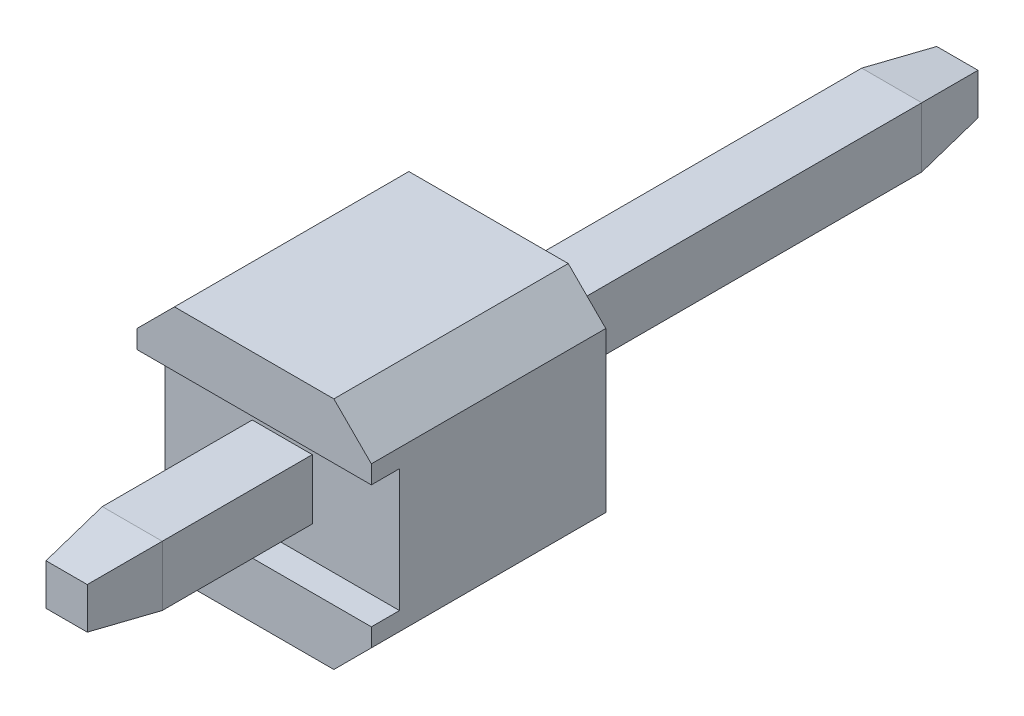
ISO-10303-21;
HEADER;
FILE_DESCRIPTION(('STEP AP214'),'2;1');
FILE_NAME('part.step','',(''),(''),'','','');
FILE_SCHEMA(('AUTOMOTIVE_DESIGN { 1 0 10303 214 1 1 1 1 }'));
ENDSEC;
DATA;
#1=APPLICATION_CONTEXT('core data for automotive mechanical design processes');
#2=APPLICATION_PROTOCOL_DEFINITION('international standard','automotive_design',2000,#1);
#3=PRODUCT_CONTEXT('',#1,'mechanical');
#4=PRODUCT('Part','Part','',(#3));
#5=PRODUCT_RELATED_PRODUCT_CATEGORY('part','',(#4));
#6=PRODUCT_DEFINITION_FORMATION('','',#4);
#7=PRODUCT_DEFINITION_CONTEXT('part definition',#1,'design');
#8=PRODUCT_DEFINITION('design','',#6,#7);
#9=PRODUCT_DEFINITION_SHAPE('','',#8);
#10=(LENGTH_UNIT() NAMED_UNIT(*) SI_UNIT(.MILLI.,.METRE.));
#11=(NAMED_UNIT(*) PLANE_ANGLE_UNIT() SI_UNIT($,.RADIAN.));
#12=(NAMED_UNIT(*) SI_UNIT($,.STERADIAN.) SOLID_ANGLE_UNIT());
#13=UNCERTAINTY_MEASURE_WITH_UNIT(LENGTH_MEASURE(1.E-05),#10,'distance_accuracy_value','');
#14=(GEOMETRIC_REPRESENTATION_CONTEXT(3) GLOBAL_UNCERTAINTY_ASSIGNED_CONTEXT((#13)) GLOBAL_UNIT_ASSIGNED_CONTEXT((#10,
#11,#12)) REPRESENTATION_CONTEXT('',''));
#15=CARTESIAN_POINT('',(0.,0.,0.));
#16=DIRECTION('',(0.,0.,1.));
#17=DIRECTION('',(1.,0.,0.));
#18=AXIS2_PLACEMENT_3D('',#15,#16,#17);
#19=CARTESIAN_POINT('',(-0.16,-0.27,-4.65));
#20=DIRECTION('',(0.,-0.989949493661167,-0.14142135623731));
#21=DIRECTION('',(0.,0.14142135623731,-0.989949493661167));
#22=AXIS2_PLACEMENT_3D('',#19,#20,#21);
#23=PLANE('',#22);
#24=DIRECTION('',(1.,0.,0.));
#25=VECTOR('',#24,1.);
#26=CARTESIAN_POINT('',(-0.16,-0.22,-5.));
#27=LINE('',#26,#25);
#28=CARTESIAN_POINT('',(-0.22,-0.22,-5.));
#29=VERTEX_POINT('',#28);
#30=CARTESIAN_POINT('',(0.22,-0.22,-5.));
#31=VERTEX_POINT('',#30);
#32=EDGE_CURVE('P0_E11',#29,#31,#27,.T.);
#33=ORIENTED_EDGE('',*,*,#32,.T.);
#34=DIRECTION('',(0.140028008402801,-0.140028008402801,0.980196058819607));
#35=VECTOR('',#34,1.);
#36=CARTESIAN_POINT('',(0.22,-0.22,-5.));
#37=LINE('',#36,#35);
#38=CARTESIAN_POINT('',(0.32,-0.32,-4.3));
#39=VERTEX_POINT('',#38);
#40=EDGE_CURVE('P0_E28',#31,#39,#37,.T.);
#41=ORIENTED_EDGE('',*,*,#40,.T.);
#42=DIRECTION('',(-1.,0.,0.));
#43=VECTOR('',#42,1.);
#44=CARTESIAN_POINT('',(-0.16,-0.32,-4.3));
#45=LINE('',#44,#43);
#46=CARTESIAN_POINT('',(-0.32,-0.32,-4.3));
#47=VERTEX_POINT('',#46);
#48=EDGE_CURVE('P0_E143',#39,#47,#45,.T.);
#49=ORIENTED_EDGE('',*,*,#48,.T.);
#50=DIRECTION('',(-0.140028008402801,-0.140028008402801,0.980196058819607));
#51=VECTOR('',#50,1.);
#52=CARTESIAN_POINT('',(-0.22,-0.22,-5.));
#53=LINE('',#52,#51);
#54=EDGE_CURVE('P0_E122',#29,#47,#53,.T.);
#55=ORIENTED_EDGE('',*,*,#54,.F.);
#56=EDGE_LOOP('',(#33,#41,#49,#55));
#57=FACE_BOUND('',#56,.T.);
#58=ADVANCED_FACE('P0_F17',(#57),#23,.T.);
#59=CARTESIAN_POINT('',(0.27,-0.16,-4.65));
#60=DIRECTION('',(0.989949493661167,0.,-0.14142135623731));
#61=DIRECTION('',(0.,-1.,0.));
#62=AXIS2_PLACEMENT_3D('',#59,#60,#61);
#63=PLANE('',#62);
#64=DIRECTION('',(0.,1.,0.));
#65=VECTOR('',#64,1.);
#66=CARTESIAN_POINT('',(0.22,-0.16,-5.));
#67=LINE('',#66,#65);
#68=CARTESIAN_POINT('',(0.22,0.22,-5.));
#69=VERTEX_POINT('',#68);
#70=EDGE_CURVE('P0_E144',#31,#69,#67,.T.);
#71=ORIENTED_EDGE('',*,*,#70,.T.);
#72=DIRECTION('',(0.140028008402801,0.140028008402801,0.980196058819607));
#73=VECTOR('',#72,1.);
#74=CARTESIAN_POINT('',(0.22,0.22,-5.));
#75=LINE('',#74,#73);
#76=CARTESIAN_POINT('',(0.32,0.32,-4.3));
#77=VERTEX_POINT('',#76);
#78=EDGE_CURVE('P0_E147',#69,#77,#75,.T.);
#79=ORIENTED_EDGE('',*,*,#78,.T.);
#80=DIRECTION('',(0.,-1.,0.));
#81=VECTOR('',#80,1.);
#82=CARTESIAN_POINT('',(0.32,-0.16,-4.3));
#83=LINE('',#82,#81);
#84=EDGE_CURVE('P0_E126',#77,#39,#83,.T.);
#85=ORIENTED_EDGE('',*,*,#84,.T.);
#86=ORIENTED_EDGE('',*,*,#40,.F.);
#87=EDGE_LOOP('',(#71,#79,#85,#86));
#88=FACE_BOUND('',#87,.T.);
#89=ADVANCED_FACE('P0_F164',(#88),#63,.T.);
#90=CARTESIAN_POINT('',(0.16,0.27,-4.65));
#91=DIRECTION('',(0.,0.989949493661167,-0.14142135623731));
#92=DIRECTION('',(-1.,0.,0.));
#93=AXIS2_PLACEMENT_3D('',#90,#91,#92);
#94=PLANE('',#93);
#95=DIRECTION('',(-1.,0.,0.));
#96=VECTOR('',#95,1.);
#97=CARTESIAN_POINT('',(0.16,0.22,-5.));
#98=LINE('',#97,#96);
#99=CARTESIAN_POINT('',(-0.22,0.22,-5.));
#100=VERTEX_POINT('',#99);
#101=EDGE_CURVE('P0_E123',#69,#100,#98,.T.);
#102=ORIENTED_EDGE('',*,*,#101,.T.);
#103=DIRECTION('',(-0.140028008402801,0.140028008402801,0.980196058819607));
#104=VECTOR('',#103,1.);
#105=CARTESIAN_POINT('',(-0.22,0.22,-5.));
#106=LINE('',#105,#104);
#107=CARTESIAN_POINT('',(-0.32,0.32,-4.3));
#108=VERTEX_POINT('',#107);
#109=EDGE_CURVE('P0_E127',#100,#108,#106,.T.);
#110=ORIENTED_EDGE('',*,*,#109,.T.);
#111=DIRECTION('',(1.,0.,0.));
#112=VECTOR('',#111,1.);
#113=CARTESIAN_POINT('',(0.16,0.32,-4.3));
#114=LINE('',#113,#112);
#115=EDGE_CURVE('P0_E98',#108,#77,#114,.T.);
#116=ORIENTED_EDGE('',*,*,#115,.T.);
#117=ORIENTED_EDGE('',*,*,#78,.F.);
#118=EDGE_LOOP('',(#102,#110,#116,#117));
#119=FACE_BOUND('',#118,.T.);
#120=ADVANCED_FACE('P0_F232',(#119),#94,.T.);
#121=CARTESIAN_POINT('',(-0.27,0.16,-4.65));
#122=DIRECTION('',(-0.989949493661167,0.,-0.14142135623731));
#123=DIRECTION('',(-0.14142135623731,0.,0.989949493661167));
#124=AXIS2_PLACEMENT_3D('',#121,#122,#123);
#125=PLANE('',#124);
#126=DIRECTION('',(0.,1.,0.));
#127=VECTOR('',#126,1.);
#128=CARTESIAN_POINT('',(-0.32,0.16,-4.3));
#129=LINE('',#128,#127);
#130=EDGE_CURVE('P0_E121',#47,#108,#129,.T.);
#131=ORIENTED_EDGE('',*,*,#130,.T.);
#132=ORIENTED_EDGE('',*,*,#109,.F.);
#133=DIRECTION('',(0.,-1.,0.));
#134=VECTOR('',#133,1.);
#135=CARTESIAN_POINT('',(-0.22,0.16,-5.));
#136=LINE('',#135,#134);
#137=EDGE_CURVE('P0_E117',#100,#29,#136,.T.);
#138=ORIENTED_EDGE('',*,*,#137,.T.);
#139=ORIENTED_EDGE('',*,*,#54,.T.);
#140=EDGE_LOOP('',(#131,#132,#138,#139));
#141=FACE_BOUND('',#140,.T.);
#142=ADVANCED_FACE('P0_F236',(#141),#125,.T.);
#143=CARTESIAN_POINT('',(-0.32,0.32,0.));
#144=DIRECTION('',(-1.,0.,0.));
#145=DIRECTION('',(0.,0.,1.));
#146=AXIS2_PLACEMENT_3D('',#143,#144,#145);
#147=PLANE('',#146);
#148=ORIENTED_EDGE('',*,*,#130,.F.);
#149=DIRECTION('',(0.,0.,1.));
#150=VECTOR('',#149,1.);
#151=CARTESIAN_POINT('',(-0.32,-0.32,0.));
#152=LINE('',#151,#150);
#153=CARTESIAN_POINT('',(-0.32,-0.32,2.));
#154=VERTEX_POINT('',#153);
#155=EDGE_CURVE('P0_E86',#47,#154,#152,.T.);
#156=ORIENTED_EDGE('',*,*,#155,.T.);
#157=DIRECTION('',(0.,-1.,0.));
#158=VECTOR('',#157,1.);
#159=CARTESIAN_POINT('',(-0.32,0.16,2.));
#160=LINE('',#159,#158);
#161=CARTESIAN_POINT('',(-0.32,0.32,2.));
#162=VERTEX_POINT('',#161);
#163=EDGE_CURVE('P0_E80',#162,#154,#160,.T.);
#164=ORIENTED_EDGE('',*,*,#163,.F.);
#165=DIRECTION('',(0.,0.,1.));
#166=VECTOR('',#165,1.);
#167=CARTESIAN_POINT('',(-0.32,0.32,0.));
#168=LINE('',#167,#166);
#169=EDGE_CURVE('P0_E84',#108,#162,#168,.T.);
#170=ORIENTED_EDGE('',*,*,#169,.F.);
#171=EDGE_LOOP('',(#148,#156,#164,#170));
#172=FACE_BOUND('',#171,.T.);
#173=ADVANCED_FACE('P0_F83',(#172),#147,.T.);
#174=CARTESIAN_POINT('',(-0.32,-0.32,0.));
#175=DIRECTION('',(0.,-1.,0.));
#176=DIRECTION('',(0.,0.,-1.));
#177=AXIS2_PLACEMENT_3D('',#174,#175,#176);
#178=PLANE('',#177);
#179=ORIENTED_EDGE('',*,*,#48,.F.);
#180=DIRECTION('',(0.,0.,1.));
#181=VECTOR('',#180,1.);
#182=CARTESIAN_POINT('',(0.32,-0.32,0.));
#183=LINE('',#182,#181);
#184=CARTESIAN_POINT('',(0.32,-0.32,2.));
#185=VERTEX_POINT('',#184);
#186=EDGE_CURVE('P0_E101',#39,#185,#183,.T.);
#187=ORIENTED_EDGE('',*,*,#186,.T.);
#188=DIRECTION('',(1.,0.,0.));
#189=VECTOR('',#188,1.);
#190=CARTESIAN_POINT('',(-0.16,-0.32,2.));
#191=LINE('',#190,#189);
#192=EDGE_CURVE('P0_E91',#154,#185,#191,.T.);
#193=ORIENTED_EDGE('',*,*,#192,.F.);
#194=ORIENTED_EDGE('',*,*,#155,.F.);
#195=EDGE_LOOP('',(#179,#187,#193,#194));
#196=FACE_BOUND('',#195,.T.);
#197=ADVANCED_FACE('P0_F19',(#196),#178,.T.);
#198=CARTESIAN_POINT('',(0.,0.,-5.));
#199=DIRECTION('',(0.,0.,-1.));
#200=DIRECTION('',(0.,-1.,0.));
#201=AXIS2_PLACEMENT_3D('',#198,#199,#200);
#202=PLANE('',#201);
#203=ORIENTED_EDGE('',*,*,#32,.F.);
#204=ORIENTED_EDGE('',*,*,#137,.F.);
#205=ORIENTED_EDGE('',*,*,#101,.F.);
#206=ORIENTED_EDGE('',*,*,#70,.F.);
#207=EDGE_LOOP('',(#203,#204,#205,#206));
#208=FACE_BOUND('',#207,.T.);
#209=ADVANCED_FACE('P0_F217',(#208),#202,.T.);
#210=CARTESIAN_POINT('',(0.32,-0.32,0.));
#211=DIRECTION('',(1.,0.,0.));
#212=DIRECTION('',(0.,1.,0.));
#213=AXIS2_PLACEMENT_3D('',#210,#211,#212);
#214=PLANE('',#213);
#215=ORIENTED_EDGE('',*,*,#84,.F.);
#216=DIRECTION('',(0.,0.,-1.));
#217=VECTOR('',#216,1.);
#218=CARTESIAN_POINT('',(0.32,0.32,0.));
#219=LINE('',#218,#217);
#220=CARTESIAN_POINT('',(0.32,0.32,2.));
#221=VERTEX_POINT('',#220);
#222=EDGE_CURVE('P0_E102',#221,#77,#219,.T.);
#223=ORIENTED_EDGE('',*,*,#222,.F.);
#224=DIRECTION('',(0.,1.,0.));
#225=VECTOR('',#224,1.);
#226=CARTESIAN_POINT('',(0.32,-0.16,2.));
#227=LINE('',#226,#225);
#228=EDGE_CURVE('P0_E107',#185,#221,#227,.T.);
#229=ORIENTED_EDGE('',*,*,#228,.F.);
#230=ORIENTED_EDGE('',*,*,#186,.F.);
#231=EDGE_LOOP('',(#215,#223,#229,#230));
#232=FACE_BOUND('',#231,.T.);
#233=ADVANCED_FACE('P0_F172',(#232),#214,.T.);
#234=CARTESIAN_POINT('',(0.32,0.32,0.));
#235=DIRECTION('',(0.,1.,0.));
#236=DIRECTION('',(1.,0.,0.));
#237=AXIS2_PLACEMENT_3D('',#234,#235,#236);
#238=PLANE('',#237);
#239=ORIENTED_EDGE('',*,*,#115,.F.);
#240=ORIENTED_EDGE('',*,*,#169,.T.);
#241=DIRECTION('',(-1.,0.,0.));
#242=VECTOR('',#241,1.);
#243=CARTESIAN_POINT('',(0.16,0.32,2.));
#244=LINE('',#243,#242);
#245=EDGE_CURVE('P0_E21',#221,#162,#244,.T.);
#246=ORIENTED_EDGE('',*,*,#245,.F.);
#247=ORIENTED_EDGE('',*,*,#222,.T.);
#248=EDGE_LOOP('',(#239,#240,#246,#247));
#249=FACE_BOUND('',#248,.T.);
#250=ADVANCED_FACE('P0_F96',(#249),#238,.T.);
#251=CARTESIAN_POINT('',(0.,0.,2.));
#252=DIRECTION('',(0.,0.,1.));
#253=DIRECTION('',(1.,0.,0.));
#254=AXIS2_PLACEMENT_3D('',#251,#252,#253);
#255=PLANE('',#254);
#256=ORIENTED_EDGE('',*,*,#245,.T.);
#257=ORIENTED_EDGE('',*,*,#163,.T.);
#258=ORIENTED_EDGE('',*,*,#192,.T.);
#259=ORIENTED_EDGE('',*,*,#228,.T.);
#260=EDGE_LOOP('',(#256,#257,#258,#259));
#261=FACE_BOUND('',#260,.T.);
#262=ADVANCED_FACE('P0_F105',(#261),#255,.T.);
#263=CLOSED_SHELL('',(#58,#89,#120,#142,#173,#197,#209,#233,#250,#262));
#264=MANIFOLD_SOLID_BREP('P0_B1',#263);
#265=CARTESIAN_POINT('',(-1.25,0.655430015301126,2.5));
#266=DIRECTION('',(0.,1.,0.));
#267=DIRECTION('',(1.,0.,0.));
#268=AXIS2_PLACEMENT_3D('',#265,#266,#267);
#269=PLANE('',#268);
#270=DIRECTION('',(1.,0.,0.));
#271=VECTOR('',#270,1.);
#272=CARTESIAN_POINT('',(-0.625,0.655430015301126,2.5));
#273=LINE('',#272,#271);
#274=CARTESIAN_POINT('',(-1.25,0.655430015301126,2.5));
#275=VERTEX_POINT('',#274);
#276=CARTESIAN_POINT('',(1.25,0.655430015301126,2.5));
#277=VERTEX_POINT('',#276);
#278=EDGE_CURVE('P1_E231',#275,#277,#273,.T.);
#279=ORIENTED_EDGE('',*,*,#278,.F.);
#280=DIRECTION('',(0.,0.,1.));
#281=VECTOR('',#280,1.);
#282=CARTESIAN_POINT('',(-1.25,0.655430015301126,1.25));
#283=LINE('',#282,#281);
#284=CARTESIAN_POINT('',(-1.25,0.655430015301126,2.2));
#285=VERTEX_POINT('',#284);
#286=EDGE_CURVE('P1_E41',#285,#275,#283,.T.);
#287=ORIENTED_EDGE('',*,*,#286,.F.);
#288=DIRECTION('',(1.,0.,0.));
#289=VECTOR('',#288,1.);
#290=CARTESIAN_POINT('',(-1.25,0.655430015301126,2.2));
#291=LINE('',#290,#289);
#292=CARTESIAN_POINT('',(1.25,0.655430015301126,2.2));
#293=VERTEX_POINT('',#292);
#294=EDGE_CURVE('P1_E11',#285,#293,#291,.T.);
#295=ORIENTED_EDGE('',*,*,#294,.T.);
#296=DIRECTION('',(0.,0.,-1.));
#297=VECTOR('',#296,1.);
#298=CARTESIAN_POINT('',(1.25,0.655430015301126,1.25));
#299=LINE('',#298,#297);
#300=EDGE_CURVE('P1_E243',#277,#293,#299,.T.);
#301=ORIENTED_EDGE('',*,*,#300,.F.);
#302=EDGE_LOOP('',(#279,#287,#295,#301));
#303=FACE_BOUND('',#302,.T.);
#304=ADVANCED_FACE('P1_F17',(#303),#269,.F.);
#305=CARTESIAN_POINT('',(1.25,-0.655430015301126,2.5));
#306=DIRECTION('',(0.,-1.,0.));
#307=DIRECTION('',(0.,0.,-1.));
#308=AXIS2_PLACEMENT_3D('',#305,#306,#307);
#309=PLANE('',#308);
#310=DIRECTION('',(-1.,0.,0.));
#311=VECTOR('',#310,1.);
#312=CARTESIAN_POINT('',(0.625,-0.655430015301126,2.5));
#313=LINE('',#312,#311);
#314=CARTESIAN_POINT('',(1.25,-0.655430015301126,2.5));
#315=VERTEX_POINT('',#314);
#316=CARTESIAN_POINT('',(-1.25,-0.655430015301126,2.5));
#317=VERTEX_POINT('',#316);
#318=EDGE_CURVE('P1_E235',#315,#317,#313,.T.);
#319=ORIENTED_EDGE('',*,*,#318,.F.);
#320=DIRECTION('',(0.,0.,1.));
#321=VECTOR('',#320,1.);
#322=CARTESIAN_POINT('',(1.25,-0.655430015301126,1.25));
#323=LINE('',#322,#321);
#324=CARTESIAN_POINT('',(1.25,-0.655430015301126,2.2));
#325=VERTEX_POINT('',#324);
#326=EDGE_CURVE('P1_E298',#325,#315,#323,.T.);
#327=ORIENTED_EDGE('',*,*,#326,.F.);
#328=DIRECTION('',(-1.,0.,0.));
#329=VECTOR('',#328,1.);
#330=CARTESIAN_POINT('',(1.25,-0.655430015301126,2.2));
#331=LINE('',#330,#329);
#332=CARTESIAN_POINT('',(-1.25,-0.655430015301126,2.2));
#333=VERTEX_POINT('',#332);
#334=EDGE_CURVE('P1_E28',#325,#333,#331,.T.);
#335=ORIENTED_EDGE('',*,*,#334,.T.);
#336=DIRECTION('',(0.,0.,-1.));
#337=VECTOR('',#336,1.);
#338=CARTESIAN_POINT('',(-1.25,-0.655430015301126,1.25));
#339=LINE('',#338,#337);
#340=EDGE_CURVE('P1_E242',#317,#333,#339,.T.);
#341=ORIENTED_EDGE('',*,*,#340,.F.);
#342=EDGE_LOOP('',(#319,#327,#335,#341));
#343=FACE_BOUND('',#342,.T.);
#344=ADVANCED_FACE('P1_F409',(#343),#309,.F.);
#345=CARTESIAN_POINT('',(0.,0.,2.2));
#346=DIRECTION('',(0.,0.,-1.));
#347=DIRECTION('',(0.,-1.,0.));
#348=AXIS2_PLACEMENT_3D('',#345,#346,#347);
#349=PLANE('',#348);
#350=DIRECTION('',(0.,-1.,0.));
#351=VECTOR('',#350,1.);
#352=CARTESIAN_POINT('',(1.25,-0.625,2.2));
#353=LINE('',#352,#351);
#354=EDGE_CURVE('P1_E246',#293,#325,#353,.T.);
#355=ORIENTED_EDGE('',*,*,#354,.F.);
#356=ORIENTED_EDGE('',*,*,#294,.F.);
#357=DIRECTION('',(0.,1.,0.));
#358=VECTOR('',#357,1.);
#359=CARTESIAN_POINT('',(-1.25,0.625,2.2));
#360=LINE('',#359,#358);
#361=EDGE_CURVE('P1_E306',#333,#285,#360,.T.);
#362=ORIENTED_EDGE('',*,*,#361,.F.);
#363=ORIENTED_EDGE('',*,*,#334,.F.);
#364=EDGE_LOOP('',(#355,#356,#362,#363));
#365=FACE_BOUND('',#364,.T.);
#366=DIRECTION('',(0.,-1.,0.));
#367=VECTOR('',#366,1.);
#368=CARTESIAN_POINT('',(-0.32,-0.16,2.2));
#369=LINE('',#368,#367);
#370=CARTESIAN_POINT('',(-0.32,0.32,2.2));
#371=VERTEX_POINT('',#370);
#372=CARTESIAN_POINT('',(-0.32,-0.32,2.2));
#373=VERTEX_POINT('',#372);
#374=EDGE_CURVE('P1_E225',#371,#373,#369,.T.);
#375=ORIENTED_EDGE('',*,*,#374,.F.);
#376=DIRECTION('',(-1.,0.,0.));
#377=VECTOR('',#376,1.);
#378=CARTESIAN_POINT('',(-0.16,0.32,2.2));
#379=LINE('',#378,#377);
#380=CARTESIAN_POINT('',(0.32,0.32,2.2));
#381=VERTEX_POINT('',#380);
#382=EDGE_CURVE('P1_E215',#381,#371,#379,.T.);
#383=ORIENTED_EDGE('',*,*,#382,.F.);
#384=DIRECTION('',(0.,1.,0.));
#385=VECTOR('',#384,1.);
#386=CARTESIAN_POINT('',(0.32,0.16,2.2));
#387=LINE('',#386,#385);
#388=CARTESIAN_POINT('',(0.32,-0.32,2.2));
#389=VERTEX_POINT('',#388);
#390=EDGE_CURVE('P1_E297',#389,#381,#387,.T.);
#391=ORIENTED_EDGE('',*,*,#390,.F.);
#392=DIRECTION('',(1.,0.,0.));
#393=VECTOR('',#392,1.);
#394=CARTESIAN_POINT('',(0.16,-0.32,2.2));
#395=LINE('',#394,#393);
#396=EDGE_CURVE('P1_E250',#373,#389,#395,.T.);
#397=ORIENTED_EDGE('',*,*,#396,.F.);
#398=EDGE_LOOP('',(#375,#383,#391,#397));
#399=FACE_BOUND('',#398,.T.);
#400=ADVANCED_FACE('P1_F415',(#365,#399),#349,.F.);
#401=CARTESIAN_POINT('',(0.,0.,2.5));
#402=DIRECTION('',(0.,0.,1.));
#403=DIRECTION('',(1.,0.,0.));
#404=AXIS2_PLACEMENT_3D('',#401,#402,#403);
#405=PLANE('',#404);
#406=ORIENTED_EDGE('',*,*,#318,.T.);
#407=DIRECTION('',(0.,-1.,0.));
#408=VECTOR('',#407,1.);
#409=CARTESIAN_POINT('',(-1.25,-1.25,2.5));
#410=LINE('',#409,#408);
#411=CARTESIAN_POINT('',(-1.25,-0.85,2.5));
#412=VERTEX_POINT('',#411);
#413=EDGE_CURVE('P1_E239',#317,#412,#410,.T.);
#414=ORIENTED_EDGE('',*,*,#413,.T.);
#415=DIRECTION('',(-0.707106781186548,0.707106781186548,0.));
#416=VECTOR('',#415,1.);
#417=CARTESIAN_POINT('',(-1.05,-1.05,2.5));
#418=LINE('',#417,#416);
#419=CARTESIAN_POINT('',(-0.85,-1.25,2.5));
#420=VERTEX_POINT('',#419);
#421=EDGE_CURVE('P1_E261',#420,#412,#418,.T.);
#422=ORIENTED_EDGE('',*,*,#421,.F.);
#423=DIRECTION('',(1.,0.,0.));
#424=VECTOR('',#423,1.);
#425=CARTESIAN_POINT('',(1.25,-1.25,2.5));
#426=LINE('',#425,#424);
#427=CARTESIAN_POINT('',(0.85,-1.25,2.5));
#428=VERTEX_POINT('',#427);
#429=EDGE_CURVE('P1_E266',#420,#428,#426,.T.);
#430=ORIENTED_EDGE('',*,*,#429,.T.);
#431=DIRECTION('',(-0.707106781186548,-0.707106781186548,0.));
#432=VECTOR('',#431,1.);
#433=CARTESIAN_POINT('',(1.05,-1.05,2.5));
#434=LINE('',#433,#432);
#435=CARTESIAN_POINT('',(1.25,-0.85,2.5));
#436=VERTEX_POINT('',#435);
#437=EDGE_CURVE('P1_E203',#436,#428,#434,.T.);
#438=ORIENTED_EDGE('',*,*,#437,.F.);
#439=DIRECTION('',(0.,1.,0.));
#440=VECTOR('',#439,1.);
#441=CARTESIAN_POINT('',(1.25,1.25,2.5));
#442=LINE('',#441,#440);
#443=EDGE_CURVE('P1_E233',#436,#315,#442,.T.);
#444=ORIENTED_EDGE('',*,*,#443,.T.);
#445=EDGE_LOOP('',(#406,#414,#422,#430,#438,#444));
#446=FACE_BOUND('',#445,.T.);
#447=ADVANCED_FACE('P1_F426',(#446),#405,.T.);
#448=CARTESIAN_POINT('',(0.,0.,2.5));
#449=DIRECTION('',(0.,0.,1.));
#450=DIRECTION('',(1.,0.,0.));
#451=AXIS2_PLACEMENT_3D('',#448,#449,#450);
#452=PLANE('',#451);
#453=ORIENTED_EDGE('',*,*,#278,.T.);
#454=DIRECTION('',(0.,1.,0.));
#455=VECTOR('',#454,1.);
#456=CARTESIAN_POINT('',(1.25,1.25,2.5));
#457=LINE('',#456,#455);
#458=CARTESIAN_POINT('',(1.25,0.85,2.5));
#459=VERTEX_POINT('',#458);
#460=EDGE_CURVE('P1_E187',#277,#459,#457,.T.);
#461=ORIENTED_EDGE('',*,*,#460,.T.);
#462=DIRECTION('',(0.707106781186548,-0.707106781186548,0.));
#463=VECTOR('',#462,1.);
#464=CARTESIAN_POINT('',(1.05,1.05,2.5));
#465=LINE('',#464,#463);
#466=CARTESIAN_POINT('',(0.85,1.25,2.5));
#467=VERTEX_POINT('',#466);
#468=EDGE_CURVE('P1_E182',#467,#459,#465,.T.);
#469=ORIENTED_EDGE('',*,*,#468,.F.);
#470=DIRECTION('',(-1.,0.,0.));
#471=VECTOR('',#470,1.);
#472=CARTESIAN_POINT('',(-1.25,1.25,2.5));
#473=LINE('',#472,#471);
#474=CARTESIAN_POINT('',(-0.85,1.25,2.5));
#475=VERTEX_POINT('',#474);
#476=EDGE_CURVE('P1_E178',#467,#475,#473,.T.);
#477=ORIENTED_EDGE('',*,*,#476,.T.);
#478=DIRECTION('',(0.707106781186548,0.707106781186548,0.));
#479=VECTOR('',#478,1.);
#480=CARTESIAN_POINT('',(-1.05,1.05,2.5));
#481=LINE('',#480,#479);
#482=CARTESIAN_POINT('',(-1.25,0.85,2.5));
#483=VERTEX_POINT('',#482);
#484=EDGE_CURVE('P1_E165',#483,#475,#481,.T.);
#485=ORIENTED_EDGE('',*,*,#484,.F.);
#486=DIRECTION('',(0.,-1.,0.));
#487=VECTOR('',#486,1.);
#488=CARTESIAN_POINT('',(-1.25,-1.25,2.5));
#489=LINE('',#488,#487);
#490=EDGE_CURVE('P1_E188',#483,#275,#489,.T.);
#491=ORIENTED_EDGE('',*,*,#490,.T.);
#492=EDGE_LOOP('',(#453,#461,#469,#477,#485,#491));
#493=FACE_BOUND('',#492,.T.);
#494=ADVANCED_FACE('P1_F180',(#493),#452,.T.);
#495=CARTESIAN_POINT('',(1.25,-1.25,0.));
#496=DIRECTION('',(1.,0.,0.));
#497=DIRECTION('',(0.,1.,0.));
#498=AXIS2_PLACEMENT_3D('',#495,#496,#497);
#499=PLANE('',#498);
#500=ORIENTED_EDGE('',*,*,#300,.T.);
#501=ORIENTED_EDGE('',*,*,#354,.T.);
#502=ORIENTED_EDGE('',*,*,#326,.T.);
#503=ORIENTED_EDGE('',*,*,#443,.F.);
#504=DIRECTION('',(0.,0.,1.));
#505=VECTOR('',#504,1.);
#506=CARTESIAN_POINT('',(1.25,-0.85,0.));
#507=LINE('',#506,#505);
#508=CARTESIAN_POINT('',(1.25,-0.85,0.));
#509=VERTEX_POINT('',#508);
#510=EDGE_CURVE('P1_E313',#509,#436,#507,.T.);
#511=ORIENTED_EDGE('',*,*,#510,.F.);
#512=DIRECTION('',(0.,-1.,0.));
#513=VECTOR('',#512,1.);
#514=CARTESIAN_POINT('',(1.25,1.25,0.));
#515=LINE('',#514,#513);
#516=CARTESIAN_POINT('',(1.25,0.85,0.));
#517=VERTEX_POINT('',#516);
#518=EDGE_CURVE('P1_E211',#517,#509,#515,.T.);
#519=ORIENTED_EDGE('',*,*,#518,.F.);
#520=DIRECTION('',(0.,0.,-1.));
#521=VECTOR('',#520,1.);
#522=CARTESIAN_POINT('',(1.25,0.85,0.));
#523=LINE('',#522,#521);
#524=EDGE_CURVE('P1_E214',#459,#517,#523,.T.);
#525=ORIENTED_EDGE('',*,*,#524,.F.);
#526=ORIENTED_EDGE('',*,*,#460,.F.);
#527=EDGE_LOOP('',(#500,#501,#502,#503,#511,#519,#525,#526));
#528=FACE_BOUND('',#527,.T.);
#529=ADVANCED_FACE('P1_F348',(#528),#499,.T.);
#530=CARTESIAN_POINT('',(0.32,0.32,0.));
#531=DIRECTION('',(-1.,0.,0.));
#532=DIRECTION('',(0.,0.,1.));
#533=AXIS2_PLACEMENT_3D('',#530,#531,#532);
#534=PLANE('',#533);
#535=ORIENTED_EDGE('',*,*,#390,.T.);
#536=DIRECTION('',(0.,0.,1.));
#537=VECTOR('',#536,1.);
#538=CARTESIAN_POINT('',(0.32,0.32,0.));
#539=LINE('',#538,#537);
#540=CARTESIAN_POINT('',(0.32,0.32,0.));
#541=VERTEX_POINT('',#540);
#542=EDGE_CURVE('P1_E264',#541,#381,#539,.T.);
#543=ORIENTED_EDGE('',*,*,#542,.F.);
#544=DIRECTION('',(0.,-1.,0.));
#545=VECTOR('',#544,1.);
#546=CARTESIAN_POINT('',(0.32,0.32,0.));
#547=LINE('',#546,#545);
#548=CARTESIAN_POINT('',(0.32,-0.32,0.));
#549=VERTEX_POINT('',#548);
#550=EDGE_CURVE('P1_E273',#541,#549,#547,.T.);
#551=ORIENTED_EDGE('',*,*,#550,.T.);
#552=DIRECTION('',(0.,0.,1.));
#553=VECTOR('',#552,1.);
#554=CARTESIAN_POINT('',(0.32,-0.32,0.));
#555=LINE('',#554,#553);
#556=EDGE_CURVE('P1_E219',#549,#389,#555,.T.);
#557=ORIENTED_EDGE('',*,*,#556,.T.);
#558=EDGE_LOOP('',(#535,#543,#551,#557));
#559=FACE_BOUND('',#558,.T.);
#560=ADVANCED_FACE('P1_F437',(#559),#534,.T.);
#561=CARTESIAN_POINT('',(-0.32,0.32,0.));
#562=DIRECTION('',(0.,-1.,0.));
#563=DIRECTION('',(0.,0.,-1.));
#564=AXIS2_PLACEMENT_3D('',#561,#562,#563);
#565=PLANE('',#564);
#566=ORIENTED_EDGE('',*,*,#382,.T.);
#567=DIRECTION('',(0.,0.,1.));
#568=VECTOR('',#567,1.);
#569=CARTESIAN_POINT('',(-0.32,0.32,0.));
#570=LINE('',#569,#568);
#571=CARTESIAN_POINT('',(-0.32,0.32,0.));
#572=VERTEX_POINT('',#571);
#573=EDGE_CURVE('P1_E226',#572,#371,#570,.T.);
#574=ORIENTED_EDGE('',*,*,#573,.F.);
#575=DIRECTION('',(1.,0.,0.));
#576=VECTOR('',#575,1.);
#577=CARTESIAN_POINT('',(-0.32,0.32,0.));
#578=LINE('',#577,#576);
#579=EDGE_CURVE('P1_E220',#572,#541,#578,.T.);
#580=ORIENTED_EDGE('',*,*,#579,.T.);
#581=ORIENTED_EDGE('',*,*,#542,.T.);
#582=EDGE_LOOP('',(#566,#574,#580,#581));
#583=FACE_BOUND('',#582,.T.);
#584=ADVANCED_FACE('P1_F424',(#583),#565,.T.);
#585=CARTESIAN_POINT('',(-1.05,-1.05,0.));
#586=DIRECTION('',(-0.707106781186548,-0.707106781186548,0.));
#587=DIRECTION('',(-0.707106781186548,0.707106781186548,0.));
#588=AXIS2_PLACEMENT_3D('',#585,#586,#587);
#589=PLANE('',#588);
#590=ORIENTED_EDGE('',*,*,#421,.T.);
#591=DIRECTION('',(0.,0.,-1.));
#592=VECTOR('',#591,1.);
#593=CARTESIAN_POINT('',(-1.25,-0.85,0.));
#594=LINE('',#593,#592);
#595=CARTESIAN_POINT('',(-1.25,-0.85,0.));
#596=VERTEX_POINT('',#595);
#597=EDGE_CURVE('P1_E265',#412,#596,#594,.T.);
#598=ORIENTED_EDGE('',*,*,#597,.T.);
#599=DIRECTION('',(0.707106781186548,-0.707106781186548,0.));
#600=VECTOR('',#599,1.);
#601=CARTESIAN_POINT('',(-1.05,-1.05,0.));
#602=LINE('',#601,#600);
#603=CARTESIAN_POINT('',(-0.85,-1.25,0.));
#604=VERTEX_POINT('',#603);
#605=EDGE_CURVE('P1_E255',#596,#604,#602,.T.);
#606=ORIENTED_EDGE('',*,*,#605,.T.);
#607=DIRECTION('',(0.,0.,1.));
#608=VECTOR('',#607,1.);
#609=CARTESIAN_POINT('',(-0.85,-1.25,0.));
#610=LINE('',#609,#608);
#611=EDGE_CURVE('P1_E251',#604,#420,#610,.T.);
#612=ORIENTED_EDGE('',*,*,#611,.T.);
#613=EDGE_LOOP('',(#590,#598,#606,#612));
#614=FACE_BOUND('',#613,.T.);
#615=ADVANCED_FACE('P1_F420',(#614),#589,.T.);
#616=CARTESIAN_POINT('',(-1.25,-1.25,0.));
#617=DIRECTION('',(0.,-1.,0.));
#618=DIRECTION('',(0.,0.,-1.));
#619=AXIS2_PLACEMENT_3D('',#616,#617,#618);
#620=PLANE('',#619);
#621=ORIENTED_EDGE('',*,*,#611,.F.);
#622=DIRECTION('',(-1.,0.,0.));
#623=VECTOR('',#622,1.);
#624=CARTESIAN_POINT('',(1.25,-1.25,0.));
#625=LINE('',#624,#623);
#626=CARTESIAN_POINT('',(0.85,-1.25,0.));
#627=VERTEX_POINT('',#626);
#628=EDGE_CURVE('P1_E175',#627,#604,#625,.T.);
#629=ORIENTED_EDGE('',*,*,#628,.F.);
#630=DIRECTION('',(0.,0.,-1.));
#631=VECTOR('',#630,1.);
#632=CARTESIAN_POINT('',(0.85,-1.25,0.));
#633=LINE('',#632,#631);
#634=EDGE_CURVE('P1_E207',#428,#627,#633,.T.);
#635=ORIENTED_EDGE('',*,*,#634,.F.);
#636=ORIENTED_EDGE('',*,*,#429,.F.);
#637=EDGE_LOOP('',(#621,#629,#635,#636));
#638=FACE_BOUND('',#637,.T.);
#639=ADVANCED_FACE('P1_F423',(#638),#620,.T.);
#640=CARTESIAN_POINT('',(0.,0.,0.));
#641=DIRECTION('',(0.,0.,1.));
#642=DIRECTION('',(1.,0.,0.));
#643=AXIS2_PLACEMENT_3D('',#640,#641,#642);
#644=PLANE('',#643);
#645=ORIENTED_EDGE('',*,*,#605,.F.);
#646=DIRECTION('',(0.,1.,0.));
#647=VECTOR('',#646,1.);
#648=CARTESIAN_POINT('',(-1.25,-1.25,0.));
#649=LINE('',#648,#647);
#650=CARTESIAN_POINT('',(-1.25,0.85,0.));
#651=VERTEX_POINT('',#650);
#652=EDGE_CURVE('P1_E210',#596,#651,#649,.T.);
#653=ORIENTED_EDGE('',*,*,#652,.T.);
#654=DIRECTION('',(-0.707106781186548,-0.707106781186548,0.));
#655=VECTOR('',#654,1.);
#656=CARTESIAN_POINT('',(-1.05,1.05,0.));
#657=LINE('',#656,#655);
#658=CARTESIAN_POINT('',(-0.85,1.25,0.));
#659=VERTEX_POINT('',#658);
#660=EDGE_CURVE('P1_E194',#659,#651,#657,.T.);
#661=ORIENTED_EDGE('',*,*,#660,.F.);
#662=DIRECTION('',(1.,0.,0.));
#663=VECTOR('',#662,1.);
#664=CARTESIAN_POINT('',(-1.25,1.25,0.));
#665=LINE('',#664,#663);
#666=CARTESIAN_POINT('',(0.85,1.25,0.));
#667=VERTEX_POINT('',#666);
#668=EDGE_CURVE('P1_E192',#659,#667,#665,.T.);
#669=ORIENTED_EDGE('',*,*,#668,.T.);
#670=DIRECTION('',(-0.707106781186548,0.707106781186548,0.));
#671=VECTOR('',#670,1.);
#672=CARTESIAN_POINT('',(1.05,1.05,0.));
#673=LINE('',#672,#671);
#674=EDGE_CURVE('P1_E258',#517,#667,#673,.T.);
#675=ORIENTED_EDGE('',*,*,#674,.F.);
#676=ORIENTED_EDGE('',*,*,#518,.T.);
#677=DIRECTION('',(0.707106781186548,0.707106781186548,0.));
#678=VECTOR('',#677,1.);
#679=CARTESIAN_POINT('',(1.05,-1.05,0.));
#680=LINE('',#679,#678);
#681=EDGE_CURVE('P1_E319',#627,#509,#680,.T.);
#682=ORIENTED_EDGE('',*,*,#681,.F.);
#683=ORIENTED_EDGE('',*,*,#628,.T.);
#684=EDGE_LOOP('',(#645,#653,#661,#669,#675,#676,#682,#683));
#685=FACE_BOUND('',#684,.T.);
#686=ORIENTED_EDGE('',*,*,#579,.F.);
#687=DIRECTION('',(0.,1.,0.));
#688=VECTOR('',#687,1.);
#689=CARTESIAN_POINT('',(-0.32,-0.32,0.));
#690=LINE('',#689,#688);
#691=CARTESIAN_POINT('',(-0.32,-0.32,0.));
#692=VERTEX_POINT('',#691);
#693=EDGE_CURVE('P1_E221',#692,#572,#690,.T.);
#694=ORIENTED_EDGE('',*,*,#693,.F.);
#695=DIRECTION('',(-1.,0.,0.));
#696=VECTOR('',#695,1.);
#697=CARTESIAN_POINT('',(0.32,-0.32,0.));
#698=LINE('',#697,#696);
#699=EDGE_CURVE('P1_E21',#549,#692,#698,.T.);
#700=ORIENTED_EDGE('',*,*,#699,.F.);
#701=ORIENTED_EDGE('',*,*,#550,.F.);
#702=EDGE_LOOP('',(#686,#694,#700,#701));
#703=FACE_BOUND('',#702,.T.);
#704=ADVANCED_FACE('P1_F19',(#685,#703),#644,.F.);
#705=CARTESIAN_POINT('',(-1.05,1.05,0.));
#706=DIRECTION('',(-0.707106781186548,0.707106781186548,0.));
#707=DIRECTION('',(0.,0.,1.));
#708=AXIS2_PLACEMENT_3D('',#705,#706,#707);
#709=PLANE('',#708);
#710=ORIENTED_EDGE('',*,*,#484,.T.);
#711=DIRECTION('',(0.,0.,-1.));
#712=VECTOR('',#711,1.);
#713=CARTESIAN_POINT('',(-0.85,1.25,0.));
#714=LINE('',#713,#712);
#715=EDGE_CURVE('P1_E169',#475,#659,#714,.T.);
#716=ORIENTED_EDGE('',*,*,#715,.T.);
#717=ORIENTED_EDGE('',*,*,#660,.T.);
#718=DIRECTION('',(0.,0.,1.));
#719=VECTOR('',#718,1.);
#720=CARTESIAN_POINT('',(-1.25,0.85,0.));
#721=LINE('',#720,#719);
#722=EDGE_CURVE('P1_E171',#651,#483,#721,.T.);
#723=ORIENTED_EDGE('',*,*,#722,.T.);
#724=EDGE_LOOP('',(#710,#716,#717,#723));
#725=FACE_BOUND('',#724,.T.);
#726=ADVANCED_FACE('P1_F167',(#725),#709,.T.);
#727=CARTESIAN_POINT('',(1.25,1.25,0.));
#728=DIRECTION('',(0.,1.,0.));
#729=DIRECTION('',(1.,0.,0.));
#730=AXIS2_PLACEMENT_3D('',#727,#728,#729);
#731=PLANE('',#730);
#732=ORIENTED_EDGE('',*,*,#715,.F.);
#733=ORIENTED_EDGE('',*,*,#476,.F.);
#734=DIRECTION('',(0.,0.,1.));
#735=VECTOR('',#734,1.);
#736=CARTESIAN_POINT('',(0.85,1.25,0.));
#737=LINE('',#736,#735);
#738=EDGE_CURVE('P1_E206',#667,#467,#737,.T.);
#739=ORIENTED_EDGE('',*,*,#738,.F.);
#740=ORIENTED_EDGE('',*,*,#668,.F.);
#741=EDGE_LOOP('',(#732,#733,#739,#740));
#742=FACE_BOUND('',#741,.T.);
#743=ADVANCED_FACE('P1_F190',(#742),#731,.T.);
#744=CARTESIAN_POINT('',(1.05,1.05,0.));
#745=DIRECTION('',(0.707106781186548,0.707106781186548,0.));
#746=DIRECTION('',(0.,0.,-1.));
#747=AXIS2_PLACEMENT_3D('',#744,#745,#746);
#748=PLANE('',#747);
#749=ORIENTED_EDGE('',*,*,#468,.T.);
#750=ORIENTED_EDGE('',*,*,#524,.T.);
#751=ORIENTED_EDGE('',*,*,#674,.T.);
#752=ORIENTED_EDGE('',*,*,#738,.T.);
#753=EDGE_LOOP('',(#749,#750,#751,#752));
#754=FACE_BOUND('',#753,.T.);
#755=ADVANCED_FACE('P1_F351',(#754),#748,.T.);
#756=CARTESIAN_POINT('',(1.05,-1.05,0.));
#757=DIRECTION('',(0.707106781186548,-0.707106781186548,0.));
#758=DIRECTION('',(0.,0.,-1.));
#759=AXIS2_PLACEMENT_3D('',#756,#757,#758);
#760=PLANE('',#759);
#761=ORIENTED_EDGE('',*,*,#437,.T.);
#762=ORIENTED_EDGE('',*,*,#634,.T.);
#763=ORIENTED_EDGE('',*,*,#681,.T.);
#764=ORIENTED_EDGE('',*,*,#510,.T.);
#765=EDGE_LOOP('',(#761,#762,#763,#764));
#766=FACE_BOUND('',#765,.T.);
#767=ADVANCED_FACE('P1_F434',(#766),#760,.T.);
#768=CARTESIAN_POINT('',(-0.32,-0.32,0.));
#769=DIRECTION('',(1.,0.,0.));
#770=DIRECTION('',(0.,1.,0.));
#771=AXIS2_PLACEMENT_3D('',#768,#769,#770);
#772=PLANE('',#771);
#773=ORIENTED_EDGE('',*,*,#374,.T.);
#774=DIRECTION('',(0.,0.,1.));
#775=VECTOR('',#774,1.);
#776=CARTESIAN_POINT('',(-0.32,-0.32,0.));
#777=LINE('',#776,#775);
#778=EDGE_CURVE('P1_E227',#692,#373,#777,.T.);
#779=ORIENTED_EDGE('',*,*,#778,.F.);
#780=ORIENTED_EDGE('',*,*,#693,.T.);
#781=ORIENTED_EDGE('',*,*,#573,.T.);
#782=EDGE_LOOP('',(#773,#779,#780,#781));
#783=FACE_BOUND('',#782,.T.);
#784=ADVANCED_FACE('P1_F404',(#783),#772,.T.);
#785=CARTESIAN_POINT('',(0.32,-0.32,0.));
#786=DIRECTION('',(0.,1.,0.));
#787=DIRECTION('',(1.,0.,0.));
#788=AXIS2_PLACEMENT_3D('',#785,#786,#787);
#789=PLANE('',#788);
#790=ORIENTED_EDGE('',*,*,#396,.T.);
#791=ORIENTED_EDGE('',*,*,#556,.F.);
#792=ORIENTED_EDGE('',*,*,#699,.T.);
#793=ORIENTED_EDGE('',*,*,#778,.T.);
#794=EDGE_LOOP('',(#790,#791,#792,#793));
#795=FACE_BOUND('',#794,.T.);
#796=ADVANCED_FACE('P1_F399',(#795),#789,.T.);
#797=CARTESIAN_POINT('',(-1.25,1.25,0.));
#798=DIRECTION('',(-1.,0.,0.));
#799=DIRECTION('',(0.,0.,1.));
#800=AXIS2_PLACEMENT_3D('',#797,#798,#799);
#801=PLANE('',#800);
#802=ORIENTED_EDGE('',*,*,#286,.T.);
#803=ORIENTED_EDGE('',*,*,#490,.F.);
#804=ORIENTED_EDGE('',*,*,#722,.F.);
#805=ORIENTED_EDGE('',*,*,#652,.F.);
#806=ORIENTED_EDGE('',*,*,#597,.F.);
#807=ORIENTED_EDGE('',*,*,#413,.F.);
#808=ORIENTED_EDGE('',*,*,#340,.T.);
#809=ORIENTED_EDGE('',*,*,#361,.T.);
#810=EDGE_LOOP('',(#802,#803,#804,#805,#806,#807,#808,#809));
#811=FACE_BOUND('',#810,.T.);
#812=ADVANCED_FACE('P1_F397',(#811),#801,.T.);
#813=CLOSED_SHELL('',(#304,#344,#400,#447,#494,#529,#560,#584,#615,#639,#704,#726,#743,#755,
#767,#784,#796,#812));
#814=MANIFOLD_SOLID_BREP('P1_B1',#813);
#815=CARTESIAN_POINT('',(0.27,-0.16,4.15));
#816=DIRECTION('',(0.989949493661167,0.,0.141421356237309));
#817=DIRECTION('',(0.,-1.,0.));
#818=AXIS2_PLACEMENT_3D('',#815,#816,#817);
#819=PLANE('',#818);
#820=DIRECTION('',(0.,-1.,0.));
#821=VECTOR('',#820,1.);
#822=CARTESIAN_POINT('',(0.22,-0.16,4.5));
#823=LINE('',#822,#821);
#824=CARTESIAN_POINT('',(0.22,0.22,4.5));
#825=VERTEX_POINT('',#824);
#826=CARTESIAN_POINT('',(0.22,-0.22,4.5));
#827=VERTEX_POINT('',#826);
#828=EDGE_CURVE('P2_E11',#825,#827,#823,.T.);
#829=ORIENTED_EDGE('',*,*,#828,.T.);
#830=DIRECTION('',(0.140028008402801,-0.140028008402801,-0.980196058819607));
#831=VECTOR('',#830,1.);
#832=CARTESIAN_POINT('',(0.22,-0.22,4.5));
#833=LINE('',#832,#831);
#834=CARTESIAN_POINT('',(0.32,-0.32,3.8));
#835=VERTEX_POINT('',#834);
#836=EDGE_CURVE('P2_E28',#827,#835,#833,.T.);
#837=ORIENTED_EDGE('',*,*,#836,.T.);
#838=DIRECTION('',(0.,1.,0.));
#839=VECTOR('',#838,1.);
#840=CARTESIAN_POINT('',(0.32,-0.16,3.8));
#841=LINE('',#840,#839);
#842=CARTESIAN_POINT('',(0.32,0.32,3.8));
#843=VERTEX_POINT('',#842);
#844=EDGE_CURVE('P2_E149',#835,#843,#841,.T.);
#845=ORIENTED_EDGE('',*,*,#844,.T.);
#846=DIRECTION('',(0.140028008402801,0.140028008402801,-0.980196058819607));
#847=VECTOR('',#846,1.);
#848=CARTESIAN_POINT('',(0.22,0.22,4.5));
#849=LINE('',#848,#847);
#850=EDGE_CURVE('P2_E64',#825,#843,#849,.T.);
#851=ORIENTED_EDGE('',*,*,#850,.F.);
#852=EDGE_LOOP('',(#829,#837,#845,#851));
#853=FACE_BOUND('',#852,.T.);
#854=ADVANCED_FACE('P2_F17',(#853),#819,.T.);
#855=CARTESIAN_POINT('',(-0.16,-0.27,4.15));
#856=DIRECTION('',(0.,-0.989949493661167,0.141421356237309));
#857=DIRECTION('',(-1.,0.,0.));
#858=AXIS2_PLACEMENT_3D('',#855,#856,#857);
#859=PLANE('',#858);
#860=DIRECTION('',(-1.,0.,0.));
#861=VECTOR('',#860,1.);
#862=CARTESIAN_POINT('',(-0.16,-0.22,4.5));
#863=LINE('',#862,#861);
#864=CARTESIAN_POINT('',(-0.22,-0.22,4.5));
#865=VERTEX_POINT('',#864);
#866=EDGE_CURVE('P2_E152',#827,#865,#863,.T.);
#867=ORIENTED_EDGE('',*,*,#866,.T.);
#868=DIRECTION('',(-0.140028008402801,-0.140028008402801,-0.980196058819607));
#869=VECTOR('',#868,1.);
#870=CARTESIAN_POINT('',(-0.22,-0.22,4.5));
#871=LINE('',#870,#869);
#872=CARTESIAN_POINT('',(-0.32,-0.32,3.8));
#873=VERTEX_POINT('',#872);
#874=EDGE_CURVE('P2_E57',#865,#873,#871,.T.);
#875=ORIENTED_EDGE('',*,*,#874,.T.);
#876=DIRECTION('',(1.,0.,0.));
#877=VECTOR('',#876,1.);
#878=CARTESIAN_POINT('',(-0.16,-0.32,3.8));
#879=LINE('',#878,#877);
#880=EDGE_CURVE('P2_E176',#873,#835,#879,.T.);
#881=ORIENTED_EDGE('',*,*,#880,.T.);
#882=ORIENTED_EDGE('',*,*,#836,.F.);
#883=EDGE_LOOP('',(#867,#875,#881,#882));
#884=FACE_BOUND('',#883,.T.);
#885=ADVANCED_FACE('P2_F195',(#884),#859,.T.);
#886=CARTESIAN_POINT('',(-0.27,0.16,4.15));
#887=DIRECTION('',(-0.989949493661167,0.,0.141421356237309));
#888=DIRECTION('',(0.,1.,0.));
#889=AXIS2_PLACEMENT_3D('',#886,#887,#888);
#890=PLANE('',#889);
#891=DIRECTION('',(0.,1.,0.));
#892=VECTOR('',#891,1.);
#893=CARTESIAN_POINT('',(-0.22,0.16,4.5));
#894=LINE('',#893,#892);
#895=CARTESIAN_POINT('',(-0.22,0.22,4.5));
#896=VERTEX_POINT('',#895);
#897=EDGE_CURVE('P2_E123',#865,#896,#894,.T.);
#898=ORIENTED_EDGE('',*,*,#897,.T.);
#899=DIRECTION('',(-0.140028008402801,0.140028008402801,-0.980196058819607));
#900=VECTOR('',#899,1.);
#901=CARTESIAN_POINT('',(-0.22,0.22,4.5));
#902=LINE('',#901,#900);
#903=CARTESIAN_POINT('',(-0.32,0.32,3.8));
#904=VERTEX_POINT('',#903);
#905=EDGE_CURVE('P2_E109',#896,#904,#902,.T.);
#906=ORIENTED_EDGE('',*,*,#905,.T.);
#907=DIRECTION('',(0.,-1.,0.));
#908=VECTOR('',#907,1.);
#909=CARTESIAN_POINT('',(-0.32,0.16,3.8));
#910=LINE('',#909,#908);
#911=EDGE_CURVE('P2_E21',#904,#873,#910,.T.);
#912=ORIENTED_EDGE('',*,*,#911,.T.);
#913=ORIENTED_EDGE('',*,*,#874,.F.);
#914=EDGE_LOOP('',(#898,#906,#912,#913));
#915=FACE_BOUND('',#914,.T.);
#916=ADVANCED_FACE('P2_F121',(#915),#890,.T.);
#917=CARTESIAN_POINT('',(0.16,0.27,4.15));
#918=DIRECTION('',(0.,0.989949493661167,0.141421356237309));
#919=DIRECTION('',(1.,0.,0.));
#920=AXIS2_PLACEMENT_3D('',#917,#918,#919);
#921=PLANE('',#920);
#922=DIRECTION('',(-1.,0.,0.));
#923=VECTOR('',#922,1.);
#924=CARTESIAN_POINT('',(0.16,0.32,3.8));
#925=LINE('',#924,#923);
#926=EDGE_CURVE('P2_E111',#843,#904,#925,.T.);
#927=ORIENTED_EDGE('',*,*,#926,.T.);
#928=ORIENTED_EDGE('',*,*,#905,.F.);
#929=DIRECTION('',(1.,0.,0.));
#930=VECTOR('',#929,1.);
#931=CARTESIAN_POINT('',(0.16,0.22,4.5));
#932=LINE('',#931,#930);
#933=EDGE_CURVE('P2_E115',#896,#825,#932,.T.);
#934=ORIENTED_EDGE('',*,*,#933,.T.);
#935=ORIENTED_EDGE('',*,*,#850,.T.);
#936=EDGE_LOOP('',(#927,#928,#934,#935));
#937=FACE_BOUND('',#936,.T.);
#938=ADVANCED_FACE('P2_F112',(#937),#921,.T.);
#939=CARTESIAN_POINT('',(0.32,0.32,2.));
#940=DIRECTION('',(0.,1.,0.));
#941=DIRECTION('',(1.,0.,0.));
#942=AXIS2_PLACEMENT_3D('',#939,#940,#941);
#943=PLANE('',#942);
#944=ORIENTED_EDGE('',*,*,#926,.F.);
#945=DIRECTION('',(0.,0.,1.));
#946=VECTOR('',#945,1.);
#947=CARTESIAN_POINT('',(0.32,0.32,2.));
#948=LINE('',#947,#946);
#949=CARTESIAN_POINT('',(0.32,0.32,2.));
#950=VERTEX_POINT('',#949);
#951=EDGE_CURVE('P2_E140',#950,#843,#948,.T.);
#952=ORIENTED_EDGE('',*,*,#951,.F.);
#953=DIRECTION('',(-1.,0.,0.));
#954=VECTOR('',#953,1.);
#955=CARTESIAN_POINT('',(0.16,0.32,2.));
#956=LINE('',#955,#954);
#957=CARTESIAN_POINT('',(-0.32,0.32,2.));
#958=VERTEX_POINT('',#957);
#959=EDGE_CURVE('P2_E129',#950,#958,#956,.T.);
#960=ORIENTED_EDGE('',*,*,#959,.T.);
#961=DIRECTION('',(0.,0.,1.));
#962=VECTOR('',#961,1.);
#963=CARTESIAN_POINT('',(-0.32,0.32,2.));
#964=LINE('',#963,#962);
#965=EDGE_CURVE('P2_E86',#958,#904,#964,.T.);
#966=ORIENTED_EDGE('',*,*,#965,.T.);
#967=EDGE_LOOP('',(#944,#952,#960,#966));
#968=FACE_BOUND('',#967,.T.);
#969=ADVANCED_FACE('P2_F127',(#968),#943,.T.);
#970=CARTESIAN_POINT('',(0.32,-0.32,2.));
#971=DIRECTION('',(1.,0.,0.));
#972=DIRECTION('',(0.,1.,0.));
#973=AXIS2_PLACEMENT_3D('',#970,#971,#972);
#974=PLANE('',#973);
#975=ORIENTED_EDGE('',*,*,#844,.F.);
#976=DIRECTION('',(0.,0.,1.));
#977=VECTOR('',#976,1.);
#978=CARTESIAN_POINT('',(0.32,-0.32,2.));
#979=LINE('',#978,#977);
#980=CARTESIAN_POINT('',(0.32,-0.32,2.));
#981=VERTEX_POINT('',#980);
#982=EDGE_CURVE('P2_E100',#981,#835,#979,.T.);
#983=ORIENTED_EDGE('',*,*,#982,.F.);
#984=DIRECTION('',(0.,1.,0.));
#985=VECTOR('',#984,1.);
#986=CARTESIAN_POINT('',(0.32,-0.16,2.));
#987=LINE('',#986,#985);
#988=EDGE_CURVE('P2_E132',#981,#950,#987,.T.);
#989=ORIENTED_EDGE('',*,*,#988,.T.);
#990=ORIENTED_EDGE('',*,*,#951,.T.);
#991=EDGE_LOOP('',(#975,#983,#989,#990));
#992=FACE_BOUND('',#991,.T.);
#993=ADVANCED_FACE('P2_F180',(#992),#974,.T.);
#994=CARTESIAN_POINT('',(0.,0.,4.5));
#995=DIRECTION('',(0.,0.,1.));
#996=DIRECTION('',(1.,0.,0.));
#997=AXIS2_PLACEMENT_3D('',#994,#995,#996);
#998=PLANE('',#997);
#999=ORIENTED_EDGE('',*,*,#828,.F.);
#1000=ORIENTED_EDGE('',*,*,#933,.F.);
#1001=ORIENTED_EDGE('',*,*,#897,.F.);
#1002=ORIENTED_EDGE('',*,*,#866,.F.);
#1003=EDGE_LOOP('',(#999,#1000,#1001,#1002));
#1004=FACE_BOUND('',#1003,.T.);
#1005=ADVANCED_FACE('P2_F170',(#1004),#998,.T.);
#1006=CARTESIAN_POINT('',(-0.32,-0.32,2.));
#1007=DIRECTION('',(0.,-1.,0.));
#1008=DIRECTION('',(0.,0.,-1.));
#1009=AXIS2_PLACEMENT_3D('',#1006,#1007,#1008);
#1010=PLANE('',#1009);
#1011=ORIENTED_EDGE('',*,*,#880,.F.);
#1012=DIRECTION('',(0.,0.,1.));
#1013=VECTOR('',#1012,1.);
#1014=CARTESIAN_POINT('',(-0.32,-0.32,2.));
#1015=LINE('',#1014,#1013);
#1016=CARTESIAN_POINT('',(-0.32,-0.32,2.));
#1017=VERTEX_POINT('',#1016);
#1018=EDGE_CURVE('P2_E118',#1017,#873,#1015,.T.);
#1019=ORIENTED_EDGE('',*,*,#1018,.F.);
#1020=DIRECTION('',(1.,0.,0.));
#1021=VECTOR('',#1020,1.);
#1022=CARTESIAN_POINT('',(-0.16,-0.32,2.));
#1023=LINE('',#1022,#1021);
#1024=EDGE_CURVE('P2_E145',#1017,#981,#1023,.T.);
#1025=ORIENTED_EDGE('',*,*,#1024,.T.);
#1026=ORIENTED_EDGE('',*,*,#982,.T.);
#1027=EDGE_LOOP('',(#1011,#1019,#1025,#1026));
#1028=FACE_BOUND('',#1027,.T.);
#1029=ADVANCED_FACE('P2_F175',(#1028),#1010,.T.);
#1030=CARTESIAN_POINT('',(-0.32,0.32,2.));
#1031=DIRECTION('',(-1.,0.,0.));
#1032=DIRECTION('',(0.,0.,1.));
#1033=AXIS2_PLACEMENT_3D('',#1030,#1031,#1032);
#1034=PLANE('',#1033);
#1035=ORIENTED_EDGE('',*,*,#911,.F.);
#1036=ORIENTED_EDGE('',*,*,#965,.F.);
#1037=DIRECTION('',(0.,-1.,0.));
#1038=VECTOR('',#1037,1.);
#1039=CARTESIAN_POINT('',(-0.32,0.16,2.));
#1040=LINE('',#1039,#1038);
#1041=EDGE_CURVE('P2_E154',#958,#1017,#1040,.T.);
#1042=ORIENTED_EDGE('',*,*,#1041,.T.);
#1043=ORIENTED_EDGE('',*,*,#1018,.T.);
#1044=EDGE_LOOP('',(#1035,#1036,#1042,#1043));
#1045=FACE_BOUND('',#1044,.T.);
#1046=ADVANCED_FACE('P2_F19',(#1045),#1034,.T.);
#1047=CARTESIAN_POINT('',(0.,0.,2.));
#1048=DIRECTION('',(0.,0.,1.));
#1049=DIRECTION('',(1.,0.,0.));
#1050=AXIS2_PLACEMENT_3D('',#1047,#1048,#1049);
#1051=PLANE('',#1050);
#1052=ORIENTED_EDGE('',*,*,#959,.F.);
#1053=ORIENTED_EDGE('',*,*,#988,.F.);
#1054=ORIENTED_EDGE('',*,*,#1024,.F.);
#1055=ORIENTED_EDGE('',*,*,#1041,.F.);
#1056=EDGE_LOOP('',(#1052,#1053,#1054,#1055));
#1057=FACE_BOUND('',#1056,.T.);
#1058=ADVANCED_FACE('P2_F179',(#1057),#1051,.F.);
#1059=CLOSED_SHELL('',(#854,#885,#916,#938,#969,#993,#1005,#1029,#1046,#1058));
#1060=MANIFOLD_SOLID_BREP('P2_B1',#1059);
#1061=ADVANCED_BREP_SHAPE_REPRESENTATION('',(#18,#264,#814,#1060),#14);
#1062=SHAPE_DEFINITION_REPRESENTATION(#9,#1061);
ENDSEC;
END-ISO-10303-21;
